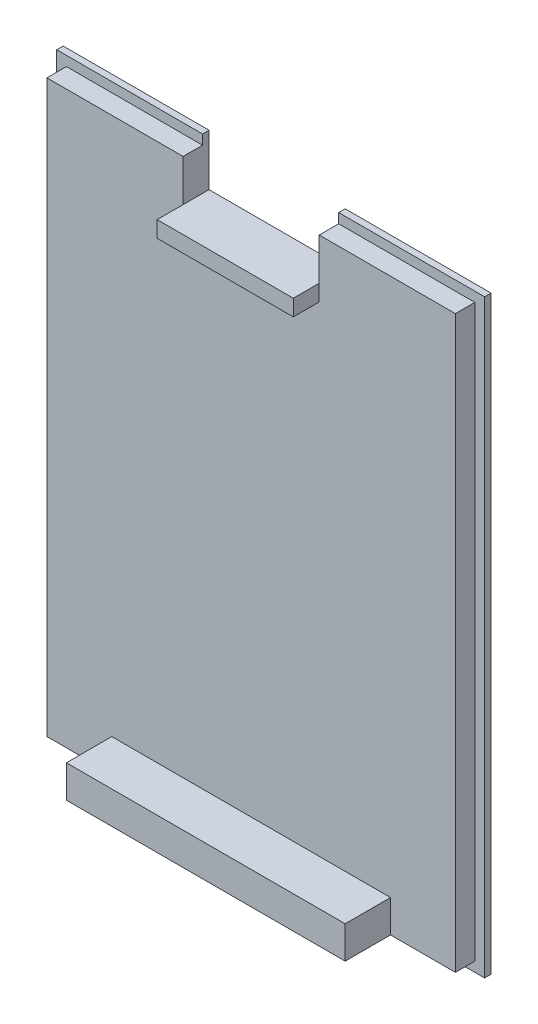
ISO-10303-21;
HEADER;
FILE_DESCRIPTION(('STEP AP214'),'2;1');
FILE_NAME('part.step','',(''),(''),'','','');
FILE_SCHEMA(('AUTOMOTIVE_DESIGN { 1 0 10303 214 1 1 1 1 }'));
ENDSEC;
DATA;
#1=APPLICATION_CONTEXT('core data for automotive mechanical design processes');
#2=APPLICATION_PROTOCOL_DEFINITION('international standard','automotive_design',2000,#1);
#3=PRODUCT_CONTEXT('',#1,'mechanical');
#4=PRODUCT('Part','Part','',(#3));
#5=PRODUCT_RELATED_PRODUCT_CATEGORY('part','',(#4));
#6=PRODUCT_DEFINITION_FORMATION('','',#4);
#7=PRODUCT_DEFINITION_CONTEXT('part definition',#1,'design');
#8=PRODUCT_DEFINITION('design','',#6,#7);
#9=PRODUCT_DEFINITION_SHAPE('','',#8);
#10=(LENGTH_UNIT() NAMED_UNIT(*) SI_UNIT(.MILLI.,.METRE.));
#11=(NAMED_UNIT(*) PLANE_ANGLE_UNIT() SI_UNIT($,.RADIAN.));
#12=(NAMED_UNIT(*) SI_UNIT($,.STERADIAN.) SOLID_ANGLE_UNIT());
#13=UNCERTAINTY_MEASURE_WITH_UNIT(LENGTH_MEASURE(1.E-05),#10,'distance_accuracy_value','');
#14=(GEOMETRIC_REPRESENTATION_CONTEXT(3) GLOBAL_UNCERTAINTY_ASSIGNED_CONTEXT((#13)) GLOBAL_UNIT_ASSIGNED_CONTEXT((#10,
#11,#12)) REPRESENTATION_CONTEXT('',''));
#15=CARTESIAN_POINT('',(0.,0.,0.));
#16=DIRECTION('',(0.,0.,1.));
#17=DIRECTION('',(1.,0.,0.));
#18=AXIS2_PLACEMENT_3D('',#15,#16,#17);
#19=CARTESIAN_POINT('',(29.5580775022705,45.466,-0.5334));
#20=DIRECTION('',(0.,-1.,0.));
#21=DIRECTION('',(0.,0.,-1.));
#22=AXIS2_PLACEMENT_3D('',#19,#20,#21);
#23=PLANE('',#22);
#24=DIRECTION('',(1.,0.,0.));
#25=VECTOR('',#24,1.);
#26=CARTESIAN_POINT('',(29.5580775022705,45.466,-0.0254));
#27=LINE('',#26,#25);
#28=CARTESIAN_POINT('',(-3.96992249772946,45.466,-0.0254));
#29=VERTEX_POINT('',#28);
#30=CARTESIAN_POINT('',(7.46007750227054,45.466,-0.0254000000000001));
#31=VERTEX_POINT('',#30);
#32=EDGE_CURVE('E328',#29,#31,#27,.T.);
#33=ORIENTED_EDGE('',*,*,#32,.T.);
#34=DIRECTION('',(0.,0.,-1.));
#35=VECTOR('',#34,1.);
#36=CARTESIAN_POINT('',(7.46007750227054,45.466,-0.5334));
#37=LINE('',#36,#35);
#38=CARTESIAN_POINT('',(7.46007750227054,45.466,-0.5334));
#39=VERTEX_POINT('',#38);
#40=EDGE_CURVE('E414',#31,#39,#37,.T.);
#41=ORIENTED_EDGE('',*,*,#40,.T.);
#42=DIRECTION('',(1.,0.,0.));
#43=VECTOR('',#42,1.);
#44=CARTESIAN_POINT('',(29.5580775022705,45.466,-0.5334));
#45=LINE('',#44,#43);
#46=CARTESIAN_POINT('',(-3.96992249772946,45.466,-0.5334));
#47=VERTEX_POINT('',#46);
#48=EDGE_CURVE('E307',#47,#39,#45,.T.);
#49=ORIENTED_EDGE('',*,*,#48,.F.);
#50=DIRECTION('',(0.,0.,1.));
#51=VECTOR('',#50,1.);
#52=CARTESIAN_POINT('',(-3.96992249772946,45.466,-0.5334));
#53=LINE('',#52,#51);
#54=EDGE_CURVE('E335',#47,#29,#53,.T.);
#55=ORIENTED_EDGE('',*,*,#54,.T.);
#56=EDGE_LOOP('',(#33,#41,#49,#55));
#57=FACE_BOUND('',#56,.T.);
#58=ADVANCED_FACE('F39',(#57),#23,.F.);
#59=CARTESIAN_POINT('',(0.,0.,1.5));
#60=DIRECTION('',(0.,0.,1.));
#61=DIRECTION('',(1.,0.,0.));
#62=AXIS2_PLACEMENT_3D('',#59,#60,#61);
#63=PLANE('',#62);
#64=DIRECTION('',(0.,-1.,0.));
#65=VECTOR('',#64,1.);
#66=CARTESIAN_POINT('',(7.46007750227054,42.704,1.5));
#67=LINE('',#66,#65);
#68=CARTESIAN_POINT('',(7.46007750227054,44.704,1.5));
#69=VERTEX_POINT('',#68);
#70=CARTESIAN_POINT('',(7.46007750227054,41.434,1.5));
#71=VERTEX_POINT('',#70);
#72=EDGE_CURVE('E226',#69,#71,#67,.T.);
#73=ORIENTED_EDGE('',*,*,#72,.F.);
#74=DIRECTION('',(-1.,0.,0.));
#75=VECTOR('',#74,1.);
#76=CARTESIAN_POINT('',(-3.20792249772946,44.704,1.5));
#77=LINE('',#76,#75);
#78=CARTESIAN_POINT('',(-3.20792249772946,44.704,1.5));
#79=VERTEX_POINT('',#78);
#80=EDGE_CURVE('E249',#69,#79,#77,.T.);
#81=ORIENTED_EDGE('',*,*,#80,.T.);
#82=DIRECTION('',(0.,-1.,0.));
#83=VECTOR('',#82,1.);
#84=CARTESIAN_POINT('',(-3.20792249772946,44.704,1.5));
#85=LINE('',#84,#83);
#86=CARTESIAN_POINT('',(-3.20792249772946,0.,1.5));
#87=VERTEX_POINT('',#86);
#88=EDGE_CURVE('E237',#79,#87,#85,.T.);
#89=ORIENTED_EDGE('',*,*,#88,.T.);
#90=DIRECTION('',(1.,0.,0.));
#91=VECTOR('',#90,1.);
#92=CARTESIAN_POINT('',(-3.20792249772946,0.,1.5));
#93=LINE('',#92,#91);
#94=CARTESIAN_POINT('',(1.87207750227054,0.,1.5));
#95=VERTEX_POINT('',#94);
#96=EDGE_CURVE('E242',#87,#95,#93,.T.);
#97=ORIENTED_EDGE('',*,*,#96,.T.);
#98=DIRECTION('',(0.,-1.,0.));
#99=VECTOR('',#98,1.);
#100=CARTESIAN_POINT('',(1.87207750227054,2.53999999999999,1.5));
#101=LINE('',#100,#99);
#102=CARTESIAN_POINT('',(1.87207750227054,2.53999999999999,1.5));
#103=VERTEX_POINT('',#102);
#104=EDGE_CURVE('E347',#103,#95,#101,.T.);
#105=ORIENTED_EDGE('',*,*,#104,.F.);
#106=DIRECTION('',(-1.,0.,0.));
#107=VECTOR('',#106,1.);
#108=CARTESIAN_POINT('',(1.87207750227054,2.53999999999999,1.5));
#109=LINE('',#108,#107);
#110=CARTESIAN_POINT('',(23.7160775022705,2.54,1.5));
#111=VERTEX_POINT('',#110);
#112=EDGE_CURVE('E63',#111,#103,#109,.T.);
#113=ORIENTED_EDGE('',*,*,#112,.F.);
#114=DIRECTION('',(0.,1.,0.));
#115=VECTOR('',#114,1.);
#116=CARTESIAN_POINT('',(23.7160775022705,2.54,1.5));
#117=LINE('',#116,#115);
#118=CARTESIAN_POINT('',(23.7160775022705,0.,1.5));
#119=VERTEX_POINT('',#118);
#120=EDGE_CURVE('E365',#119,#111,#117,.T.);
#121=ORIENTED_EDGE('',*,*,#120,.F.);
#122=CARTESIAN_POINT('',(28.7960775022705,0.,1.5));
#123=VERTEX_POINT('',#122);
#124=EDGE_CURVE('E241',#119,#123,#93,.T.);
#125=ORIENTED_EDGE('',*,*,#124,.T.);
#126=DIRECTION('',(0.,1.,0.));
#127=VECTOR('',#126,1.);
#128=CARTESIAN_POINT('',(28.7960775022705,44.704,1.5));
#129=LINE('',#128,#127);
#130=CARTESIAN_POINT('',(28.7960775022705,44.704,1.5));
#131=VERTEX_POINT('',#130);
#132=EDGE_CURVE('E245',#123,#131,#129,.T.);
#133=ORIENTED_EDGE('',*,*,#132,.T.);
#134=CARTESIAN_POINT('',(18.1280775022705,44.704,1.5));
#135=VERTEX_POINT('',#134);
#136=EDGE_CURVE('E250',#131,#135,#77,.T.);
#137=ORIENTED_EDGE('',*,*,#136,.T.);
#138=DIRECTION('',(0.,1.,0.));
#139=VECTOR('',#138,1.);
#140=CARTESIAN_POINT('',(18.1280775022705,44.704,1.5));
#141=LINE('',#140,#139);
#142=CARTESIAN_POINT('',(18.1280775022705,41.434,1.5));
#143=VERTEX_POINT('',#142);
#144=EDGE_CURVE('E385',#143,#135,#141,.T.);
#145=ORIENTED_EDGE('',*,*,#144,.F.);
#146=DIRECTION('',(0.,1.,0.));
#147=VECTOR('',#146,1.);
#148=CARTESIAN_POINT('',(18.1280775022705,42.704,1.5));
#149=LINE('',#148,#147);
#150=CARTESIAN_POINT('',(18.1280775022705,40.164,1.5));
#151=VERTEX_POINT('',#150);
#152=EDGE_CURVE('E211',#151,#143,#149,.T.);
#153=ORIENTED_EDGE('',*,*,#152,.F.);
#154=DIRECTION('',(1.,0.,0.));
#155=VECTOR('',#154,1.);
#156=CARTESIAN_POINT('',(7.46007750227054,40.164,1.5));
#157=LINE('',#156,#155);
#158=CARTESIAN_POINT('',(7.46007750227054,40.164,1.5));
#159=VERTEX_POINT('',#158);
#160=EDGE_CURVE('E217',#159,#151,#157,.T.);
#161=ORIENTED_EDGE('',*,*,#160,.F.);
#162=EDGE_CURVE('E229',#71,#159,#67,.T.);
#163=ORIENTED_EDGE('',*,*,#162,.F.);
#164=EDGE_LOOP('',(#73,#81,#89,#97,#105,#113,#121,#125,#133,#137,#145,#153,#161,#163));
#165=FACE_BOUND('',#164,.T.);
#166=ADVANCED_FACE('F401',(#165),#63,.T.);
#167=CARTESIAN_POINT('',(-3.20792249772946,44.704,-0.0254));
#168=DIRECTION('',(0.,1.,0.));
#169=DIRECTION('',(0.,0.,1.));
#170=AXIS2_PLACEMENT_3D('',#167,#168,#169);
#171=PLANE('',#170);
#172=DIRECTION('',(0.,0.,1.));
#173=VECTOR('',#172,1.);
#174=CARTESIAN_POINT('',(7.46007750227054,44.704,-2.31));
#175=LINE('',#174,#173);
#176=CARTESIAN_POINT('',(7.46007750227054,44.704,-0.0254));
#177=VERTEX_POINT('',#176);
#178=EDGE_CURVE('E387',#177,#69,#175,.T.);
#179=ORIENTED_EDGE('',*,*,#178,.F.);
#180=DIRECTION('',(-1.,0.,0.));
#181=VECTOR('',#180,1.);
#182=CARTESIAN_POINT('',(-3.20792249772946,44.704,-0.0254));
#183=LINE('',#182,#181);
#184=CARTESIAN_POINT('',(-3.20792249772946,44.704,-0.0254));
#185=VERTEX_POINT('',#184);
#186=EDGE_CURVE('E266',#177,#185,#183,.T.);
#187=ORIENTED_EDGE('',*,*,#186,.T.);
#188=DIRECTION('',(0.,0.,1.));
#189=VECTOR('',#188,1.);
#190=CARTESIAN_POINT('',(-3.20792249772946,44.704,-0.0254));
#191=LINE('',#190,#189);
#192=EDGE_CURVE('E272',#185,#79,#191,.T.);
#193=ORIENTED_EDGE('',*,*,#192,.T.);
#194=ORIENTED_EDGE('',*,*,#80,.F.);
#195=EDGE_LOOP('',(#179,#187,#193,#194));
#196=FACE_BOUND('',#195,.T.);
#197=ADVANCED_FACE('F465',(#196),#171,.T.);
#198=CARTESIAN_POINT('',(-3.20792249772946,44.704,-0.0254));
#199=DIRECTION('',(-1.,0.,0.));
#200=DIRECTION('',(0.,-1.,0.));
#201=AXIS2_PLACEMENT_3D('',#198,#199,#200);
#202=PLANE('',#201);
#203=DIRECTION('',(0.,0.,1.));
#204=VECTOR('',#203,1.);
#205=CARTESIAN_POINT('',(-3.20792249772946,0.,-0.0254));
#206=LINE('',#205,#204);
#207=CARTESIAN_POINT('',(-3.20792249772946,0.,-0.0254));
#208=VERTEX_POINT('',#207);
#209=EDGE_CURVE('E271',#208,#87,#206,.T.);
#210=ORIENTED_EDGE('',*,*,#209,.T.);
#211=ORIENTED_EDGE('',*,*,#88,.F.);
#212=ORIENTED_EDGE('',*,*,#192,.F.);
#213=DIRECTION('',(0.,-1.,0.));
#214=VECTOR('',#213,1.);
#215=CARTESIAN_POINT('',(-3.20792249772946,44.704,-0.0254));
#216=LINE('',#215,#214);
#217=EDGE_CURVE('E254',#185,#208,#216,.T.);
#218=ORIENTED_EDGE('',*,*,#217,.T.);
#219=EDGE_LOOP('',(#210,#211,#212,#218));
#220=FACE_BOUND('',#219,.T.);
#221=ADVANCED_FACE('F41',(#220),#202,.T.);
#222=DIRECTION('',(0.,0.,1.));
#223=VECTOR('',#222,1.);
#224=CARTESIAN_POINT('',(18.1280775022705,44.704,-2.31));
#225=LINE('',#224,#223);
#226=CARTESIAN_POINT('',(18.1280775022705,44.704,-0.0254));
#227=VERTEX_POINT('',#226);
#228=EDGE_CURVE('E220',#227,#135,#225,.T.);
#229=ORIENTED_EDGE('',*,*,#228,.T.);
#230=ORIENTED_EDGE('',*,*,#136,.F.);
#231=DIRECTION('',(0.,0.,1.));
#232=VECTOR('',#231,1.);
#233=CARTESIAN_POINT('',(28.7960775022705,44.704,-0.0254));
#234=LINE('',#233,#232);
#235=CARTESIAN_POINT('',(28.7960775022705,44.704,-0.0254));
#236=VERTEX_POINT('',#235);
#237=EDGE_CURVE('E277',#236,#131,#234,.T.);
#238=ORIENTED_EDGE('',*,*,#237,.F.);
#239=EDGE_CURVE('E267',#236,#227,#183,.T.);
#240=ORIENTED_EDGE('',*,*,#239,.T.);
#241=EDGE_LOOP('',(#229,#230,#238,#240));
#242=FACE_BOUND('',#241,.T.);
#243=ADVANCED_FACE('F399',(#242),#171,.T.);
#244=CARTESIAN_POINT('',(28.7960775022705,44.704,-0.0254));
#245=DIRECTION('',(1.,0.,0.));
#246=DIRECTION('',(0.,1.,0.));
#247=AXIS2_PLACEMENT_3D('',#244,#245,#246);
#248=PLANE('',#247);
#249=ORIENTED_EDGE('',*,*,#237,.T.);
#250=ORIENTED_EDGE('',*,*,#132,.F.);
#251=DIRECTION('',(0.,0.,1.));
#252=VECTOR('',#251,1.);
#253=CARTESIAN_POINT('',(28.7960775022705,0.,-0.0254));
#254=LINE('',#253,#252);
#255=CARTESIAN_POINT('',(28.7960775022705,0.,-0.0254));
#256=VERTEX_POINT('',#255);
#257=EDGE_CURVE('E280',#256,#123,#254,.T.);
#258=ORIENTED_EDGE('',*,*,#257,.F.);
#259=DIRECTION('',(0.,1.,0.));
#260=VECTOR('',#259,1.);
#261=CARTESIAN_POINT('',(28.7960775022705,44.704,-0.0254));
#262=LINE('',#261,#260);
#263=EDGE_CURVE('E262',#256,#236,#262,.T.);
#264=ORIENTED_EDGE('',*,*,#263,.T.);
#265=EDGE_LOOP('',(#249,#250,#258,#264));
#266=FACE_BOUND('',#265,.T.);
#267=ADVANCED_FACE('F406',(#266),#248,.T.);
#268=CARTESIAN_POINT('',(-3.20792249772946,0.,-0.0254));
#269=DIRECTION('',(0.,-1.,0.));
#270=DIRECTION('',(0.,0.,-1.));
#271=AXIS2_PLACEMENT_3D('',#268,#269,#270);
#272=PLANE('',#271);
#273=ORIENTED_EDGE('',*,*,#257,.T.);
#274=ORIENTED_EDGE('',*,*,#124,.F.);
#275=DIRECTION('',(0.,0.,-1.));
#276=VECTOR('',#275,1.);
#277=CARTESIAN_POINT('',(23.7160775022705,0.,5.056));
#278=LINE('',#277,#276);
#279=CARTESIAN_POINT('',(23.7160775022705,0.,5.056));
#280=VERTEX_POINT('',#279);
#281=EDGE_CURVE('E377',#280,#119,#278,.T.);
#282=ORIENTED_EDGE('',*,*,#281,.F.);
#283=DIRECTION('',(1.,0.,0.));
#284=VECTOR('',#283,1.);
#285=CARTESIAN_POINT('',(1.87207750227054,0.,5.056));
#286=LINE('',#285,#284);
#287=CARTESIAN_POINT('',(1.87207750227054,0.,5.056));
#288=VERTEX_POINT('',#287);
#289=EDGE_CURVE('E352',#288,#280,#286,.T.);
#290=ORIENTED_EDGE('',*,*,#289,.F.);
#291=DIRECTION('',(0.,0.,-1.));
#292=VECTOR('',#291,1.);
#293=CARTESIAN_POINT('',(1.87207750227054,0.,5.056));
#294=LINE('',#293,#292);
#295=EDGE_CURVE('E381',#288,#95,#294,.T.);
#296=ORIENTED_EDGE('',*,*,#295,.T.);
#297=ORIENTED_EDGE('',*,*,#96,.F.);
#298=ORIENTED_EDGE('',*,*,#209,.F.);
#299=DIRECTION('',(1.,0.,0.));
#300=VECTOR('',#299,1.);
#301=CARTESIAN_POINT('',(-3.20792249772946,0.,-0.0254));
#302=LINE('',#301,#300);
#303=EDGE_CURVE('E258',#208,#256,#302,.T.);
#304=ORIENTED_EDGE('',*,*,#303,.T.);
#305=EDGE_LOOP('',(#273,#274,#282,#290,#296,#297,#298,#304));
#306=FACE_BOUND('',#305,.T.);
#307=ADVANCED_FACE('F458',(#306),#272,.T.);
#308=CARTESIAN_POINT('',(7.46007750227054,42.704,3.532));
#309=DIRECTION('',(1.,0.,0.));
#310=DIRECTION('',(0.,0.,-1.));
#311=AXIS2_PLACEMENT_3D('',#308,#309,#310);
#312=PLANE('',#311);
#313=DIRECTION('',(0.,-1.,0.));
#314=VECTOR('',#313,1.);
#315=CARTESIAN_POINT('',(7.46007750227054,42.704,3.532));
#316=LINE('',#315,#314);
#317=CARTESIAN_POINT('',(7.46007750227054,41.434,3.532));
#318=VERTEX_POINT('',#317);
#319=CARTESIAN_POINT('',(7.46007750227054,40.164,3.532));
#320=VERTEX_POINT('',#319);
#321=EDGE_CURVE('E199',#318,#320,#316,.T.);
#322=ORIENTED_EDGE('',*,*,#321,.F.);
#323=DIRECTION('',(0.,0.,1.));
#324=VECTOR('',#323,1.);
#325=CARTESIAN_POINT('',(7.46007750227054,41.434,-4.596));
#326=LINE('',#325,#324);
#327=EDGE_CURVE('E184',#71,#318,#326,.T.);
#328=ORIENTED_EDGE('',*,*,#327,.F.);
#329=ORIENTED_EDGE('',*,*,#162,.T.);
#330=DIRECTION('',(0.,0.,-1.));
#331=VECTOR('',#330,1.);
#332=CARTESIAN_POINT('',(7.46007750227054,40.164,3.532));
#333=LINE('',#332,#331);
#334=EDGE_CURVE('E208',#320,#159,#333,.T.);
#335=ORIENTED_EDGE('',*,*,#334,.F.);
#336=EDGE_LOOP('',(#322,#328,#329,#335));
#337=FACE_BOUND('',#336,.T.);
#338=ADVANCED_FACE('F206',(#337),#312,.F.);
#339=CARTESIAN_POINT('',(7.46007750227054,40.164,3.532));
#340=DIRECTION('',(0.,1.,0.));
#341=DIRECTION('',(0.,0.,1.));
#342=AXIS2_PLACEMENT_3D('',#339,#340,#341);
#343=PLANE('',#342);
#344=ORIENTED_EDGE('',*,*,#160,.T.);
#345=DIRECTION('',(0.,0.,-1.));
#346=VECTOR('',#345,1.);
#347=CARTESIAN_POINT('',(18.1280775022705,40.164,3.532));
#348=LINE('',#347,#346);
#349=CARTESIAN_POINT('',(18.1280775022705,40.164,3.532));
#350=VERTEX_POINT('',#349);
#351=EDGE_CURVE('E225',#350,#151,#348,.T.);
#352=ORIENTED_EDGE('',*,*,#351,.F.);
#353=DIRECTION('',(1.,0.,0.));
#354=VECTOR('',#353,1.);
#355=CARTESIAN_POINT('',(7.46007750227054,40.164,3.532));
#356=LINE('',#355,#354);
#357=EDGE_CURVE('E210',#320,#350,#356,.T.);
#358=ORIENTED_EDGE('',*,*,#357,.F.);
#359=ORIENTED_EDGE('',*,*,#334,.T.);
#360=EDGE_LOOP('',(#344,#352,#358,#359));
#361=FACE_BOUND('',#360,.T.);
#362=ADVANCED_FACE('F450',(#361),#343,.F.);
#363=CARTESIAN_POINT('',(18.1280775022705,42.704,3.532));
#364=DIRECTION('',(-1.,0.,0.));
#365=DIRECTION('',(0.,0.,1.));
#366=AXIS2_PLACEMENT_3D('',#363,#364,#365);
#367=PLANE('',#366);
#368=ORIENTED_EDGE('',*,*,#152,.T.);
#369=DIRECTION('',(0.,0.,1.));
#370=VECTOR('',#369,1.);
#371=CARTESIAN_POINT('',(18.1280775022705,41.434,-4.596));
#372=LINE('',#371,#370);
#373=CARTESIAN_POINT('',(18.1280775022705,41.434,3.532));
#374=VERTEX_POINT('',#373);
#375=EDGE_CURVE('E440',#143,#374,#372,.T.);
#376=ORIENTED_EDGE('',*,*,#375,.T.);
#377=DIRECTION('',(0.,1.,0.));
#378=VECTOR('',#377,1.);
#379=CARTESIAN_POINT('',(18.1280775022705,42.704,3.532));
#380=LINE('',#379,#378);
#381=EDGE_CURVE('E202',#350,#374,#380,.T.);
#382=ORIENTED_EDGE('',*,*,#381,.F.);
#383=ORIENTED_EDGE('',*,*,#351,.T.);
#384=EDGE_LOOP('',(#368,#376,#382,#383));
#385=FACE_BOUND('',#384,.T.);
#386=ADVANCED_FACE('F446',(#385),#367,.F.);
#387=CARTESIAN_POINT('',(0.,0.,3.532));
#388=DIRECTION('',(0.,0.,1.));
#389=DIRECTION('',(1.,0.,0.));
#390=AXIS2_PLACEMENT_3D('',#387,#388,#389);
#391=PLANE('',#390);
#392=DIRECTION('',(1.,0.,0.));
#393=VECTOR('',#392,1.);
#394=CARTESIAN_POINT('',(7.46007750227054,41.434,3.532));
#395=LINE('',#394,#393);
#396=EDGE_CURVE('E187',#318,#374,#395,.T.);
#397=ORIENTED_EDGE('',*,*,#396,.F.);
#398=ORIENTED_EDGE('',*,*,#321,.T.);
#399=ORIENTED_EDGE('',*,*,#357,.T.);
#400=ORIENTED_EDGE('',*,*,#381,.T.);
#401=EDGE_LOOP('',(#397,#398,#399,#400));
#402=FACE_BOUND('',#401,.T.);
#403=ADVANCED_FACE('F198',(#402),#391,.T.);
#404=CARTESIAN_POINT('',(7.46007750227054,44.704,-2.31));
#405=DIRECTION('',(-1.,0.,0.));
#406=DIRECTION('',(0.,0.,1.));
#407=AXIS2_PLACEMENT_3D('',#404,#405,#406);
#408=PLANE('',#407);
#409=ORIENTED_EDGE('',*,*,#178,.T.);
#410=ORIENTED_EDGE('',*,*,#72,.T.);
#411=CARTESIAN_POINT('',(7.46007750227054,41.434,-0.5334));
#412=VERTEX_POINT('',#411);
#413=EDGE_CURVE('E190',#412,#71,#326,.T.);
#414=ORIENTED_EDGE('',*,*,#413,.F.);
#415=DIRECTION('',(0.,-1.,0.));
#416=VECTOR('',#415,1.);
#417=CARTESIAN_POINT('',(7.46007750227054,0.,-0.5334));
#418=LINE('',#417,#416);
#419=EDGE_CURVE('E11',#39,#412,#418,.T.);
#420=ORIENTED_EDGE('',*,*,#419,.F.);
#421=ORIENTED_EDGE('',*,*,#40,.F.);
#422=DIRECTION('',(0.,-1.,0.));
#423=VECTOR('',#422,1.);
#424=CARTESIAN_POINT('',(7.46007750227054,0.,-0.0254));
#425=LINE('',#424,#423);
#426=EDGE_CURVE('E321',#31,#177,#425,.T.);
#427=ORIENTED_EDGE('',*,*,#426,.T.);
#428=EDGE_LOOP('',(#409,#410,#414,#420,#421,#427));
#429=FACE_BOUND('',#428,.T.);
#430=ADVANCED_FACE('F438',(#429),#408,.F.);
#431=CARTESIAN_POINT('',(18.1280775022705,44.704,-2.31));
#432=DIRECTION('',(1.,0.,0.));
#433=DIRECTION('',(0.,0.,-1.));
#434=AXIS2_PLACEMENT_3D('',#431,#432,#433);
#435=PLANE('',#434);
#436=CARTESIAN_POINT('',(18.1280775022705,41.434,-0.5334));
#437=VERTEX_POINT('',#436);
#438=EDGE_CURVE('E55',#437,#143,#372,.T.);
#439=ORIENTED_EDGE('',*,*,#438,.T.);
#440=ORIENTED_EDGE('',*,*,#144,.T.);
#441=ORIENTED_EDGE('',*,*,#228,.F.);
#442=DIRECTION('',(0.,1.,0.));
#443=VECTOR('',#442,1.);
#444=CARTESIAN_POINT('',(18.1280775022705,0.,-0.0254));
#445=LINE('',#444,#443);
#446=CARTESIAN_POINT('',(18.1280775022705,45.466,-0.0254000000000001));
#447=VERTEX_POINT('',#446);
#448=EDGE_CURVE('E411',#227,#447,#445,.T.);
#449=ORIENTED_EDGE('',*,*,#448,.T.);
#450=DIRECTION('',(0.,0.,1.));
#451=VECTOR('',#450,1.);
#452=CARTESIAN_POINT('',(18.1280775022705,45.466,-0.5334));
#453=LINE('',#452,#451);
#454=CARTESIAN_POINT('',(18.1280775022705,45.466,-0.5334));
#455=VERTEX_POINT('',#454);
#456=EDGE_CURVE('E301',#455,#447,#453,.T.);
#457=ORIENTED_EDGE('',*,*,#456,.F.);
#458=DIRECTION('',(0.,1.,0.));
#459=VECTOR('',#458,1.);
#460=CARTESIAN_POINT('',(18.1280775022705,0.,-0.5334));
#461=LINE('',#460,#459);
#462=EDGE_CURVE('E48',#437,#455,#461,.T.);
#463=ORIENTED_EDGE('',*,*,#462,.F.);
#464=EDGE_LOOP('',(#439,#440,#441,#449,#457,#463));
#465=FACE_BOUND('',#464,.T.);
#466=ADVANCED_FACE('F445',(#465),#435,.F.);
#467=CARTESIAN_POINT('',(1.87207750227054,2.53999999999999,5.056));
#468=DIRECTION('',(1.,0.,0.));
#469=DIRECTION('',(0.,1.,0.));
#470=AXIS2_PLACEMENT_3D('',#467,#468,#469);
#471=PLANE('',#470);
#472=ORIENTED_EDGE('',*,*,#104,.T.);
#473=ORIENTED_EDGE('',*,*,#295,.F.);
#474=DIRECTION('',(0.,-1.,0.));
#475=VECTOR('',#474,1.);
#476=CARTESIAN_POINT('',(1.87207750227054,2.53999999999999,5.056));
#477=LINE('',#476,#475);
#478=CARTESIAN_POINT('',(1.87207750227054,2.53999999999999,5.056));
#479=VERTEX_POINT('',#478);
#480=EDGE_CURVE('E348',#479,#288,#477,.T.);
#481=ORIENTED_EDGE('',*,*,#480,.F.);
#482=DIRECTION('',(0.,0.,-1.));
#483=VECTOR('',#482,1.);
#484=CARTESIAN_POINT('',(1.87207750227054,2.53999999999999,5.056));
#485=LINE('',#484,#483);
#486=EDGE_CURVE('E361',#479,#103,#485,.T.);
#487=ORIENTED_EDGE('',*,*,#486,.T.);
#488=EDGE_LOOP('',(#472,#473,#481,#487));
#489=FACE_BOUND('',#488,.T.);
#490=ADVANCED_FACE('F495',(#489),#471,.F.);
#491=CARTESIAN_POINT('',(23.7160775022705,2.54,5.056));
#492=DIRECTION('',(-1.,0.,0.));
#493=DIRECTION('',(0.,0.,1.));
#494=AXIS2_PLACEMENT_3D('',#491,#492,#493);
#495=PLANE('',#494);
#496=ORIENTED_EDGE('',*,*,#120,.T.);
#497=DIRECTION('',(0.,0.,-1.));
#498=VECTOR('',#497,1.);
#499=CARTESIAN_POINT('',(23.7160775022705,2.54,5.056));
#500=LINE('',#499,#498);
#501=CARTESIAN_POINT('',(23.7160775022705,2.54,5.056));
#502=VERTEX_POINT('',#501);
#503=EDGE_CURVE('E373',#502,#111,#500,.T.);
#504=ORIENTED_EDGE('',*,*,#503,.F.);
#505=DIRECTION('',(0.,1.,0.));
#506=VECTOR('',#505,1.);
#507=CARTESIAN_POINT('',(23.7160775022705,2.54,5.056));
#508=LINE('',#507,#506);
#509=EDGE_CURVE('E355',#280,#502,#508,.T.);
#510=ORIENTED_EDGE('',*,*,#509,.F.);
#511=ORIENTED_EDGE('',*,*,#281,.T.);
#512=EDGE_LOOP('',(#496,#504,#510,#511));
#513=FACE_BOUND('',#512,.T.);
#514=ADVANCED_FACE('F491',(#513),#495,.F.);
#515=CARTESIAN_POINT('',(1.87207750227054,2.53999999999999,5.056));
#516=DIRECTION('',(0.,-1.,0.));
#517=DIRECTION('',(1.,0.,0.));
#518=AXIS2_PLACEMENT_3D('',#515,#516,#517);
#519=PLANE('',#518);
#520=ORIENTED_EDGE('',*,*,#112,.T.);
#521=ORIENTED_EDGE('',*,*,#486,.F.);
#522=DIRECTION('',(-1.,0.,0.));
#523=VECTOR('',#522,1.);
#524=CARTESIAN_POINT('',(1.87207750227054,2.53999999999999,5.056));
#525=LINE('',#524,#523);
#526=EDGE_CURVE('E358',#502,#479,#525,.T.);
#527=ORIENTED_EDGE('',*,*,#526,.F.);
#528=ORIENTED_EDGE('',*,*,#503,.T.);
#529=EDGE_LOOP('',(#520,#521,#527,#528));
#530=FACE_BOUND('',#529,.T.);
#531=ADVANCED_FACE('F487',(#530),#519,.F.);
#532=CARTESIAN_POINT('',(0.,0.,5.056));
#533=DIRECTION('',(0.,0.,1.));
#534=DIRECTION('',(1.,0.,0.));
#535=AXIS2_PLACEMENT_3D('',#532,#533,#534);
#536=PLANE('',#535);
#537=ORIENTED_EDGE('',*,*,#480,.T.);
#538=ORIENTED_EDGE('',*,*,#289,.T.);
#539=ORIENTED_EDGE('',*,*,#509,.T.);
#540=ORIENTED_EDGE('',*,*,#526,.T.);
#541=EDGE_LOOP('',(#537,#538,#539,#540));
#542=FACE_BOUND('',#541,.T.);
#543=ADVANCED_FACE('F484',(#542),#536,.T.);
#544=CARTESIAN_POINT('',(0.,0.,-0.0254));
#545=DIRECTION('',(0.,0.,1.));
#546=DIRECTION('',(1.,0.,0.));
#547=AXIS2_PLACEMENT_3D('',#544,#545,#546);
#548=PLANE('',#547);
#549=ORIENTED_EDGE('',*,*,#426,.F.);
#550=ORIENTED_EDGE('',*,*,#32,.F.);
#551=DIRECTION('',(0.,1.,0.));
#552=VECTOR('',#551,1.);
#553=CARTESIAN_POINT('',(-3.96992249772947,-0.762,-0.0254));
#554=LINE('',#553,#552);
#555=CARTESIAN_POINT('',(-3.96992249772947,-0.762,-0.0254));
#556=VERTEX_POINT('',#555);
#557=EDGE_CURVE('E324',#556,#29,#554,.T.);
#558=ORIENTED_EDGE('',*,*,#557,.F.);
#559=DIRECTION('',(-1.,0.,0.));
#560=VECTOR('',#559,1.);
#561=CARTESIAN_POINT('',(29.5580775022705,-0.762,-0.0254));
#562=LINE('',#561,#560);
#563=CARTESIAN_POINT('',(29.5580775022705,-0.762,-0.0254));
#564=VERTEX_POINT('',#563);
#565=EDGE_CURVE('E320',#564,#556,#562,.T.);
#566=ORIENTED_EDGE('',*,*,#565,.F.);
#567=DIRECTION('',(0.,-1.,0.));
#568=VECTOR('',#567,1.);
#569=CARTESIAN_POINT('',(29.5580775022705,-0.762,-0.0254));
#570=LINE('',#569,#568);
#571=CARTESIAN_POINT('',(29.5580775022705,45.466,-0.0254));
#572=VERTEX_POINT('',#571);
#573=EDGE_CURVE('E316',#572,#564,#570,.T.);
#574=ORIENTED_EDGE('',*,*,#573,.F.);
#575=EDGE_CURVE('E327',#447,#572,#27,.T.);
#576=ORIENTED_EDGE('',*,*,#575,.F.);
#577=ORIENTED_EDGE('',*,*,#448,.F.);
#578=ORIENTED_EDGE('',*,*,#239,.F.);
#579=ORIENTED_EDGE('',*,*,#263,.F.);
#580=ORIENTED_EDGE('',*,*,#303,.F.);
#581=ORIENTED_EDGE('',*,*,#217,.F.);
#582=ORIENTED_EDGE('',*,*,#186,.F.);
#583=EDGE_LOOP('',(#549,#550,#558,#566,#574,#576,#577,#578,#579,#580,#581,#582));
#584=FACE_BOUND('',#583,.T.);
#585=ADVANCED_FACE('F409',(#584),#548,.T.);
#586=CARTESIAN_POINT('',(29.5580775022705,-0.762,-0.5334));
#587=DIRECTION('',(-1.,0.,0.));
#588=DIRECTION('',(0.,0.,1.));
#589=AXIS2_PLACEMENT_3D('',#586,#587,#588);
#590=PLANE('',#589);
#591=ORIENTED_EDGE('',*,*,#573,.T.);
#592=DIRECTION('',(0.,0.,1.));
#593=VECTOR('',#592,1.);
#594=CARTESIAN_POINT('',(29.5580775022705,-0.762,-0.5334));
#595=LINE('',#594,#593);
#596=CARTESIAN_POINT('',(29.5580775022705,-0.762,-0.5334));
#597=VERTEX_POINT('',#596);
#598=EDGE_CURVE('E343',#597,#564,#595,.T.);
#599=ORIENTED_EDGE('',*,*,#598,.F.);
#600=DIRECTION('',(0.,-1.,0.));
#601=VECTOR('',#600,1.);
#602=CARTESIAN_POINT('',(29.5580775022705,-0.762,-0.5334));
#603=LINE('',#602,#601);
#604=CARTESIAN_POINT('',(29.5580775022705,45.466,-0.5334));
#605=VERTEX_POINT('',#604);
#606=EDGE_CURVE('E332',#605,#597,#603,.T.);
#607=ORIENTED_EDGE('',*,*,#606,.F.);
#608=DIRECTION('',(0.,0.,1.));
#609=VECTOR('',#608,1.);
#610=CARTESIAN_POINT('',(29.5580775022705,45.466,-0.5334));
#611=LINE('',#610,#609);
#612=EDGE_CURVE('E304',#605,#572,#611,.T.);
#613=ORIENTED_EDGE('',*,*,#612,.T.);
#614=EDGE_LOOP('',(#591,#599,#607,#613));
#615=FACE_BOUND('',#614,.T.);
#616=ADVANCED_FACE('F478',(#615),#590,.F.);
#617=CARTESIAN_POINT('',(29.5580775022705,-0.762,-0.5334));
#618=DIRECTION('',(0.,1.,0.));
#619=DIRECTION('',(0.,0.,1.));
#620=AXIS2_PLACEMENT_3D('',#617,#618,#619);
#621=PLANE('',#620);
#622=ORIENTED_EDGE('',*,*,#565,.T.);
#623=DIRECTION('',(0.,0.,1.));
#624=VECTOR('',#623,1.);
#625=CARTESIAN_POINT('',(-3.96992249772947,-0.762,-0.5334));
#626=LINE('',#625,#624);
#627=CARTESIAN_POINT('',(-3.96992249772947,-0.762,-0.5334));
#628=VERTEX_POINT('',#627);
#629=EDGE_CURVE('E339',#628,#556,#626,.T.);
#630=ORIENTED_EDGE('',*,*,#629,.F.);
#631=DIRECTION('',(-1.,0.,0.));
#632=VECTOR('',#631,1.);
#633=CARTESIAN_POINT('',(29.5580775022705,-0.762,-0.5334));
#634=LINE('',#633,#632);
#635=EDGE_CURVE('E312',#597,#628,#634,.T.);
#636=ORIENTED_EDGE('',*,*,#635,.F.);
#637=ORIENTED_EDGE('',*,*,#598,.T.);
#638=EDGE_LOOP('',(#622,#630,#636,#637));
#639=FACE_BOUND('',#638,.T.);
#640=ADVANCED_FACE('F431',(#639),#621,.F.);
#641=CARTESIAN_POINT('',(-3.96992249772947,-0.762,-0.5334));
#642=DIRECTION('',(1.,0.,0.));
#643=DIRECTION('',(0.,1.,0.));
#644=AXIS2_PLACEMENT_3D('',#641,#642,#643);
#645=PLANE('',#644);
#646=ORIENTED_EDGE('',*,*,#557,.T.);
#647=ORIENTED_EDGE('',*,*,#54,.F.);
#648=DIRECTION('',(0.,1.,0.));
#649=VECTOR('',#648,1.);
#650=CARTESIAN_POINT('',(-3.96992249772947,-0.762,-0.5334));
#651=LINE('',#650,#649);
#652=EDGE_CURVE('E308',#628,#47,#651,.T.);
#653=ORIENTED_EDGE('',*,*,#652,.F.);
#654=ORIENTED_EDGE('',*,*,#629,.T.);
#655=EDGE_LOOP('',(#646,#647,#653,#654));
#656=FACE_BOUND('',#655,.T.);
#657=ADVANCED_FACE('F434',(#656),#645,.F.);
#658=EDGE_CURVE('E295',#455,#605,#45,.T.);
#659=ORIENTED_EDGE('',*,*,#658,.F.);
#660=ORIENTED_EDGE('',*,*,#456,.T.);
#661=ORIENTED_EDGE('',*,*,#575,.T.);
#662=ORIENTED_EDGE('',*,*,#612,.F.);
#663=EDGE_LOOP('',(#659,#660,#661,#662));
#664=FACE_BOUND('',#663,.T.);
#665=ADVANCED_FACE('F300',(#664),#23,.F.);
#666=CARTESIAN_POINT('',(0.,0.,-0.5334));
#667=DIRECTION('',(0.,0.,1.));
#668=DIRECTION('',(1.,0.,0.));
#669=AXIS2_PLACEMENT_3D('',#666,#667,#668);
#670=PLANE('',#669);
#671=ORIENTED_EDGE('',*,*,#48,.T.);
#672=ORIENTED_EDGE('',*,*,#419,.T.);
#673=DIRECTION('',(1.,0.,0.));
#674=VECTOR('',#673,1.);
#675=CARTESIAN_POINT('',(0.,41.434,-0.5334));
#676=LINE('',#675,#674);
#677=EDGE_CURVE('E276',#412,#437,#676,.T.);
#678=ORIENTED_EDGE('',*,*,#677,.T.);
#679=ORIENTED_EDGE('',*,*,#462,.T.);
#680=ORIENTED_EDGE('',*,*,#658,.T.);
#681=ORIENTED_EDGE('',*,*,#606,.T.);
#682=ORIENTED_EDGE('',*,*,#635,.T.);
#683=ORIENTED_EDGE('',*,*,#652,.T.);
#684=EDGE_LOOP('',(#671,#672,#678,#679,#680,#681,#682,#683));
#685=FACE_BOUND('',#684,.T.);
#686=ADVANCED_FACE('F293',(#685),#670,.F.);
#687=CARTESIAN_POINT('',(7.46007750227054,41.434,-4.596));
#688=DIRECTION('',(0.,-1.,0.));
#689=DIRECTION('',(0.,0.,-1.));
#690=AXIS2_PLACEMENT_3D('',#687,#688,#689);
#691=PLANE('',#690);
#692=ORIENTED_EDGE('',*,*,#413,.T.);
#693=ORIENTED_EDGE('',*,*,#327,.T.);
#694=ORIENTED_EDGE('',*,*,#396,.T.);
#695=ORIENTED_EDGE('',*,*,#375,.F.);
#696=ORIENTED_EDGE('',*,*,#438,.F.);
#697=ORIENTED_EDGE('',*,*,#677,.F.);
#698=EDGE_LOOP('',(#692,#693,#694,#695,#696,#697));
#699=FACE_BOUND('',#698,.T.);
#700=ADVANCED_FACE('F186',(#699),#691,.F.);
#701=CLOSED_SHELL('',(#58,#166,#197,#221,#243,#267,#307,#338,#362,#386,#403,#430,#466,#490,#514,
#531,#543,#585,#616,#640,#657,#665,#686,#700));
#702=MANIFOLD_SOLID_BREP('B2',#701);
#703=ADVANCED_BREP_SHAPE_REPRESENTATION('',(#18,#702),#14);
#704=SHAPE_DEFINITION_REPRESENTATION(#9,#703);
ENDSEC;
END-ISO-10303-21;
